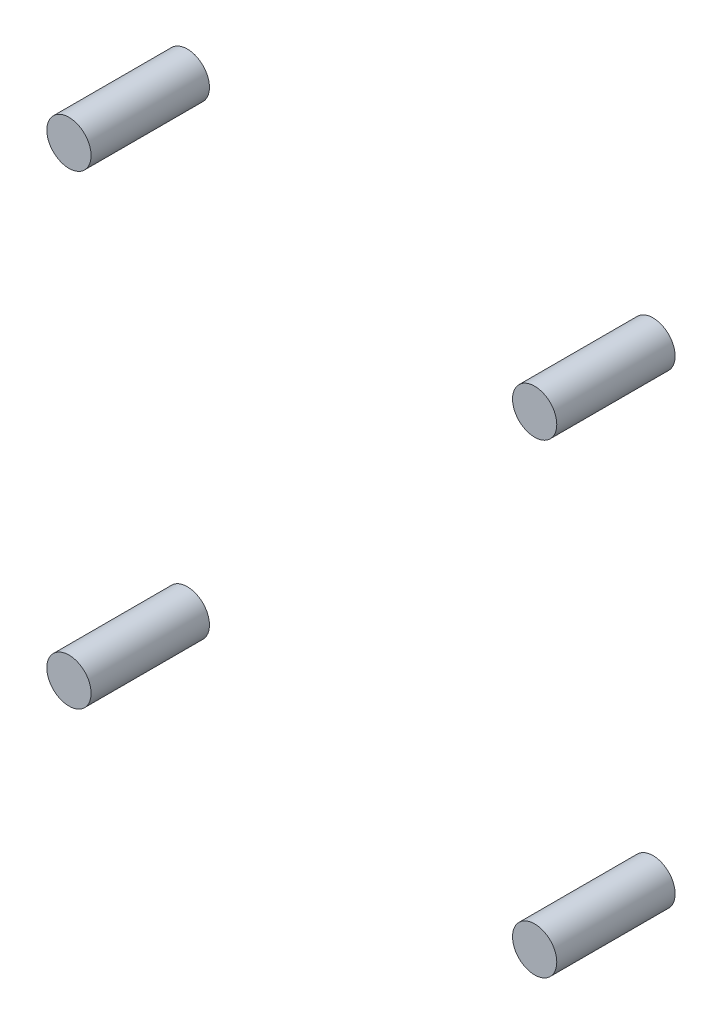
ISO-10303-21;
HEADER;
FILE_DESCRIPTION(('STEP AP214'),'2;1');
FILE_NAME('part.step','',(''),(''),'','','');
FILE_SCHEMA(('AUTOMOTIVE_DESIGN { 1 0 10303 214 1 1 1 1 }'));
ENDSEC;
DATA;
#1=APPLICATION_CONTEXT('core data for automotive mechanical design processes');
#2=APPLICATION_PROTOCOL_DEFINITION('international standard','automotive_design',2000,#1);
#3=PRODUCT_CONTEXT('',#1,'mechanical');
#4=PRODUCT('Part','Part','',(#3));
#5=PRODUCT_RELATED_PRODUCT_CATEGORY('part','',(#4));
#6=PRODUCT_DEFINITION_FORMATION('','',#4);
#7=PRODUCT_DEFINITION_CONTEXT('part definition',#1,'design');
#8=PRODUCT_DEFINITION('design','',#6,#7);
#9=PRODUCT_DEFINITION_SHAPE('','',#8);
#10=(LENGTH_UNIT() NAMED_UNIT(*) SI_UNIT(.MILLI.,.METRE.));
#11=(NAMED_UNIT(*) PLANE_ANGLE_UNIT() SI_UNIT($,.RADIAN.));
#12=(NAMED_UNIT(*) SI_UNIT($,.STERADIAN.) SOLID_ANGLE_UNIT());
#13=UNCERTAINTY_MEASURE_WITH_UNIT(LENGTH_MEASURE(1.E-05),#10,'distance_accuracy_value','');
#14=(GEOMETRIC_REPRESENTATION_CONTEXT(3) GLOBAL_UNCERTAINTY_ASSIGNED_CONTEXT((#13)) GLOBAL_UNIT_ASSIGNED_CONTEXT((#10,
#11,#12)) REPRESENTATION_CONTEXT('',''));
#15=CARTESIAN_POINT('',(0.,0.,0.));
#16=DIRECTION('',(0.,0.,1.));
#17=DIRECTION('',(1.,0.,0.));
#18=AXIS2_PLACEMENT_3D('',#15,#16,#17);
#19=CARTESIAN_POINT('',(32.6578700653686,32.6578700653662,16.6));
#20=DIRECTION('',(0.,0.,-1.));
#21=DIRECTION('',(-1.,0.,0.));
#22=AXIS2_PLACEMENT_3D('',#19,#20,#21);
#23=CYLINDRICAL_SURFACE('',#22,3.10439474843256);
#24=CARTESIAN_POINT('',(32.6578700653686,32.6578700653662,16.6));
#25=DIRECTION('',(0.,0.,1.));
#26=DIRECTION('',(1.,0.,0.));
#27=AXIS2_PLACEMENT_3D('',#24,#25,#26);
#28=CIRCLE('',#27,3.10439474843256);
#29=CARTESIAN_POINT('',(35.7622648138011,32.6578700653662,16.6));
#30=VERTEX_POINT('',#29);
#31=EDGE_CURVE('E11',#30,#30,#28,.T.);
#32=ORIENTED_EDGE('',*,*,#31,.F.);
#33=EDGE_LOOP('',(#32));
#34=FACE_BOUND('',#33,.T.);
#35=CARTESIAN_POINT('',(32.6578700653686,32.6578700653662,0.));
#36=DIRECTION('',(0.,0.,1.));
#37=DIRECTION('',(1.,0.,0.));
#38=AXIS2_PLACEMENT_3D('',#35,#36,#37);
#39=CIRCLE('',#38,3.10439474843256);
#40=CARTESIAN_POINT('',(35.7622648138011,32.6578700653662,0.));
#41=VERTEX_POINT('',#40);
#42=EDGE_CURVE('E45',#41,#41,#39,.T.);
#43=ORIENTED_EDGE('',*,*,#42,.T.);
#44=EDGE_LOOP('',(#43));
#45=FACE_BOUND('',#44,.T.);
#46=ADVANCED_FACE('F42',(#34,#45),#23,.T.);
#47=CARTESIAN_POINT('',(32.6578700653686,32.6578700653662,16.6));
#48=DIRECTION('',(0.,0.,1.));
#49=DIRECTION('',(1.,0.,0.));
#50=AXIS2_PLACEMENT_3D('',#47,#48,#49);
#51=PLANE('',#50);
#52=ORIENTED_EDGE('',*,*,#31,.T.);
#53=EDGE_LOOP('',(#52));
#54=FACE_BOUND('',#53,.T.);
#55=ADVANCED_FACE('F57',(#54),#51,.T.);
#56=CARTESIAN_POINT('',(32.6578700653686,32.6578700653662,0.));
#57=DIRECTION('',(0.,0.,1.));
#58=DIRECTION('',(1.,0.,0.));
#59=AXIS2_PLACEMENT_3D('',#56,#57,#58);
#60=PLANE('',#59);
#61=ORIENTED_EDGE('',*,*,#42,.F.);
#62=EDGE_LOOP('',(#61));
#63=FACE_BOUND('',#62,.T.);
#64=ADVANCED_FACE('F55',(#63),#60,.F.);
#65=CLOSED_SHELL('',(#46,#55,#64));
#66=MANIFOLD_SOLID_BREP('B2',#65);
#67=CARTESIAN_POINT('',(-32.6578700653644,-32.6578700653668,16.6));
#68=DIRECTION('',(0.,0.,-1.));
#69=DIRECTION('',(-1.,0.,0.));
#70=AXIS2_PLACEMENT_3D('',#67,#68,#69);
#71=CYLINDRICAL_SURFACE('',#70,3.10439474843274);
#72=CARTESIAN_POINT('',(-32.6578700653644,-32.6578700653668,16.6));
#73=DIRECTION('',(0.,0.,1.));
#74=DIRECTION('',(1.,0.,0.));
#75=AXIS2_PLACEMENT_3D('',#72,#73,#74);
#76=CIRCLE('',#75,3.10439474843274);
#77=CARTESIAN_POINT('',(-29.5534753169317,-32.6578700653668,16.6));
#78=VERTEX_POINT('',#77);
#79=EDGE_CURVE('E41',#78,#78,#76,.T.);
#80=ORIENTED_EDGE('',*,*,#79,.F.);
#81=EDGE_LOOP('',(#80));
#82=FACE_BOUND('',#81,.T.);
#83=CARTESIAN_POINT('',(-32.6578700653644,-32.6578700653668,0.));
#84=DIRECTION('',(0.,0.,1.));
#85=DIRECTION('',(1.,0.,0.));
#86=AXIS2_PLACEMENT_3D('',#83,#84,#85);
#87=CIRCLE('',#86,3.10439474843274);
#88=CARTESIAN_POINT('',(-29.5534753169317,-32.6578700653668,0.));
#89=VERTEX_POINT('',#88);
#90=EDGE_CURVE('E94',#89,#89,#87,.T.);
#91=ORIENTED_EDGE('',*,*,#90,.T.);
#92=EDGE_LOOP('',(#91));
#93=FACE_BOUND('',#92,.T.);
#94=ADVANCED_FACE('F91',(#82,#93),#71,.T.);
#95=CARTESIAN_POINT('',(-32.6578700653644,-32.6578700653668,16.6));
#96=DIRECTION('',(0.,0.,1.));
#97=DIRECTION('',(1.,0.,0.));
#98=AXIS2_PLACEMENT_3D('',#95,#96,#97);
#99=PLANE('',#98);
#100=ORIENTED_EDGE('',*,*,#79,.T.);
#101=EDGE_LOOP('',(#100));
#102=FACE_BOUND('',#101,.T.);
#103=ADVANCED_FACE('F106',(#102),#99,.T.);
#104=CARTESIAN_POINT('',(-32.6578700653644,-32.6578700653668,0.));
#105=DIRECTION('',(0.,0.,1.));
#106=DIRECTION('',(1.,0.,0.));
#107=AXIS2_PLACEMENT_3D('',#104,#105,#106);
#108=PLANE('',#107);
#109=ORIENTED_EDGE('',*,*,#90,.F.);
#110=EDGE_LOOP('',(#109));
#111=FACE_BOUND('',#110,.T.);
#112=ADVANCED_FACE('F104',(#111),#108,.F.);
#113=CLOSED_SHELL('',(#94,#103,#112));
#114=MANIFOLD_SOLID_BREP('B6',#113);
#115=CARTESIAN_POINT('',(-32.6578700653644,32.6578700653686,16.6));
#116=DIRECTION('',(0.,0.,-1.));
#117=DIRECTION('',(-1.,0.,0.));
#118=AXIS2_PLACEMENT_3D('',#115,#116,#117);
#119=CYLINDRICAL_SURFACE('',#118,3.10439474843449);
#120=CARTESIAN_POINT('',(-32.6578700653644,32.6578700653686,16.6));
#121=DIRECTION('',(0.,0.,1.));
#122=DIRECTION('',(1.,0.,0.));
#123=AXIS2_PLACEMENT_3D('',#120,#121,#122);
#124=CIRCLE('',#123,3.10439474843449);
#125=CARTESIAN_POINT('',(-29.5534753169299,32.6578700653686,16.6));
#126=VERTEX_POINT('',#125);
#127=EDGE_CURVE('E90',#126,#126,#124,.T.);
#128=ORIENTED_EDGE('',*,*,#127,.F.);
#129=EDGE_LOOP('',(#128));
#130=FACE_BOUND('',#129,.T.);
#131=CARTESIAN_POINT('',(-32.6578700653644,32.6578700653686,0.));
#132=DIRECTION('',(0.,0.,1.));
#133=DIRECTION('',(1.,0.,0.));
#134=AXIS2_PLACEMENT_3D('',#131,#132,#133);
#135=CIRCLE('',#134,3.10439474843449);
#136=CARTESIAN_POINT('',(-29.5534753169299,32.6578700653686,0.));
#137=VERTEX_POINT('',#136);
#138=EDGE_CURVE('E142',#137,#137,#135,.T.);
#139=ORIENTED_EDGE('',*,*,#138,.T.);
#140=EDGE_LOOP('',(#139));
#141=FACE_BOUND('',#140,.T.);
#142=ADVANCED_FACE('F139',(#130,#141),#119,.T.);
#143=CARTESIAN_POINT('',(-32.6578700653644,32.6578700653686,16.6));
#144=DIRECTION('',(0.,0.,1.));
#145=DIRECTION('',(1.,0.,0.));
#146=AXIS2_PLACEMENT_3D('',#143,#144,#145);
#147=PLANE('',#146);
#148=ORIENTED_EDGE('',*,*,#127,.T.);
#149=EDGE_LOOP('',(#148));
#150=FACE_BOUND('',#149,.T.);
#151=ADVANCED_FACE('F154',(#150),#147,.T.);
#152=CARTESIAN_POINT('',(-32.6578700653644,32.6578700653686,0.));
#153=DIRECTION('',(0.,0.,1.));
#154=DIRECTION('',(1.,0.,0.));
#155=AXIS2_PLACEMENT_3D('',#152,#153,#154);
#156=PLANE('',#155);
#157=ORIENTED_EDGE('',*,*,#138,.F.);
#158=EDGE_LOOP('',(#157));
#159=FACE_BOUND('',#158,.T.);
#160=ADVANCED_FACE('F152',(#159),#156,.F.);
#161=CLOSED_SHELL('',(#142,#151,#160));
#162=MANIFOLD_SOLID_BREP('B36',#161);
#163=CARTESIAN_POINT('',(32.6578700653686,-32.6578700653644,16.6));
#164=DIRECTION('',(0.,0.,-1.));
#165=DIRECTION('',(-1.,0.,0.));
#166=AXIS2_PLACEMENT_3D('',#163,#164,#165);
#167=CYLINDRICAL_SURFACE('',#166,3.10439474843439);
#168=CARTESIAN_POINT('',(32.6578700653686,-32.6578700653644,16.6));
#169=DIRECTION('',(0.,0.,1.));
#170=DIRECTION('',(1.,0.,0.));
#171=AXIS2_PLACEMENT_3D('',#168,#169,#170);
#172=CIRCLE('',#171,3.10439474843439);
#173=CARTESIAN_POINT('',(35.762264813803,-32.6578700653644,16.6));
#174=VERTEX_POINT('',#173);
#175=EDGE_CURVE('E138',#174,#174,#172,.T.);
#176=ORIENTED_EDGE('',*,*,#175,.F.);
#177=EDGE_LOOP('',(#176));
#178=FACE_BOUND('',#177,.T.);
#179=CARTESIAN_POINT('',(32.6578700653686,-32.6578700653644,0.));
#180=DIRECTION('',(0.,0.,1.));
#181=DIRECTION('',(1.,0.,0.));
#182=AXIS2_PLACEMENT_3D('',#179,#180,#181);
#183=CIRCLE('',#182,3.10439474843439);
#184=CARTESIAN_POINT('',(35.762264813803,-32.6578700653644,0.));
#185=VERTEX_POINT('',#184);
#186=EDGE_CURVE('E183',#185,#185,#183,.T.);
#187=ORIENTED_EDGE('',*,*,#186,.T.);
#188=EDGE_LOOP('',(#187));
#189=FACE_BOUND('',#188,.T.);
#190=ADVANCED_FACE('F180',(#178,#189),#167,.T.);
#191=CARTESIAN_POINT('',(32.6578700653686,-32.6578700653644,16.6));
#192=DIRECTION('',(0.,0.,1.));
#193=DIRECTION('',(1.,0.,0.));
#194=AXIS2_PLACEMENT_3D('',#191,#192,#193);
#195=PLANE('',#194);
#196=ORIENTED_EDGE('',*,*,#175,.T.);
#197=EDGE_LOOP('',(#196));
#198=FACE_BOUND('',#197,.T.);
#199=ADVANCED_FACE('F195',(#198),#195,.T.);
#200=CARTESIAN_POINT('',(32.6578700653686,-32.6578700653644,0.));
#201=DIRECTION('',(0.,0.,1.));
#202=DIRECTION('',(1.,0.,0.));
#203=AXIS2_PLACEMENT_3D('',#200,#201,#202);
#204=PLANE('',#203);
#205=ORIENTED_EDGE('',*,*,#186,.F.);
#206=EDGE_LOOP('',(#205));
#207=FACE_BOUND('',#206,.T.);
#208=ADVANCED_FACE('F193',(#207),#204,.F.);
#209=CLOSED_SHELL('',(#190,#199,#208));
#210=MANIFOLD_SOLID_BREP('B85',#209);
#211=ADVANCED_BREP_SHAPE_REPRESENTATION('',(#18,#66,#114,#162,#210),#14);
#212=SHAPE_DEFINITION_REPRESENTATION(#9,#211);
ENDSEC;
END-ISO-10303-21;
